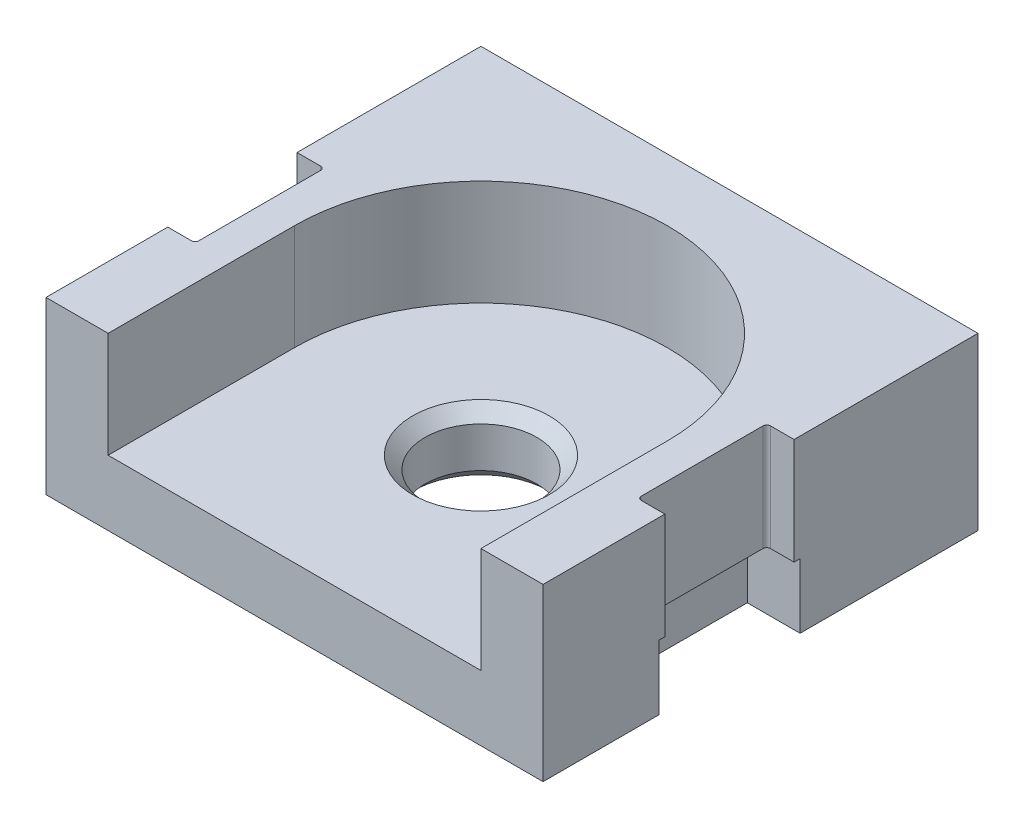
ISO-10303-21;
HEADER;
FILE_DESCRIPTION(('STEP AP214'),'2;1');
FILE_NAME('part.step','',(''),(''),'','','');
FILE_SCHEMA(('AUTOMOTIVE_DESIGN { 1 0 10303 214 1 1 1 1 }'));
ENDSEC;
DATA;
#1=APPLICATION_CONTEXT('core data for automotive mechanical design processes');
#2=APPLICATION_PROTOCOL_DEFINITION('international standard','automotive_design',2000,#1);
#3=PRODUCT_CONTEXT('',#1,'mechanical');
#4=PRODUCT('Part','Part','',(#3));
#5=PRODUCT_RELATED_PRODUCT_CATEGORY('part','',(#4));
#6=PRODUCT_DEFINITION_FORMATION('','',#4);
#7=PRODUCT_DEFINITION_CONTEXT('part definition',#1,'design');
#8=PRODUCT_DEFINITION('design','',#6,#7);
#9=PRODUCT_DEFINITION_SHAPE('','',#8);
#10=(LENGTH_UNIT() NAMED_UNIT(*) SI_UNIT(.MILLI.,.METRE.));
#11=(NAMED_UNIT(*) PLANE_ANGLE_UNIT() SI_UNIT($,.RADIAN.));
#12=(NAMED_UNIT(*) SI_UNIT($,.STERADIAN.) SOLID_ANGLE_UNIT());
#13=UNCERTAINTY_MEASURE_WITH_UNIT(LENGTH_MEASURE(1.E-05),#10,'distance_accuracy_value','');
#14=(GEOMETRIC_REPRESENTATION_CONTEXT(3) GLOBAL_UNCERTAINTY_ASSIGNED_CONTEXT((#13)) GLOBAL_UNIT_ASSIGNED_CONTEXT((#10,
#11,#12)) REPRESENTATION_CONTEXT('',''));
#15=CARTESIAN_POINT('',(0.,0.,0.));
#16=DIRECTION('',(0.,0.,1.));
#17=DIRECTION('',(1.,0.,0.));
#18=AXIS2_PLACEMENT_3D('',#15,#16,#17);
#19=CARTESIAN_POINT('',(-20.,8.,20.));
#20=DIRECTION('',(1.,0.,0.));
#21=DIRECTION('',(0.,0.,-1.));
#22=AXIS2_PLACEMENT_3D('',#19,#20,#21);
#23=PLANE('',#22);
#24=DIRECTION('',(0.,-1.,0.));
#25=VECTOR('',#24,1.);
#26=CARTESIAN_POINT('',(-20.,7.83430283036086,5.68284271247462));
#27=LINE('',#26,#25);
#28=CARTESIAN_POINT('',(-20.,-4.3,5.68284271247462));
#29=VERTEX_POINT('',#28);
#30=CARTESIAN_POINT('',(-20.,-9.5,5.68284271247462));
#31=VERTEX_POINT('',#30);
#32=EDGE_CURVE('E380',#29,#31,#27,.T.);
#33=ORIENTED_EDGE('',*,*,#32,.T.);
#34=DIRECTION('',(0.,0.,1.));
#35=VECTOR('',#34,1.);
#36=CARTESIAN_POINT('',(-20.,-9.5,20.));
#37=LINE('',#36,#35);
#38=CARTESIAN_POINT('',(-20.,-9.5,15.));
#39=VERTEX_POINT('',#38);
#40=EDGE_CURVE('E182',#31,#39,#37,.T.);
#41=ORIENTED_EDGE('',*,*,#40,.T.);
#42=DIRECTION('',(0.,1.,0.));
#43=VECTOR('',#42,1.);
#44=CARTESIAN_POINT('',(-20.,-8.,15.));
#45=LINE('',#44,#43);
#46=CARTESIAN_POINT('',(-20.,4.25,15.));
#47=VERTEX_POINT('',#46);
#48=EDGE_CURVE('E131',#39,#47,#45,.T.);
#49=ORIENTED_EDGE('',*,*,#48,.T.);
#50=DIRECTION('',(0.,0.,-1.));
#51=VECTOR('',#50,1.);
#52=CARTESIAN_POINT('',(-20.,4.25,20.));
#53=LINE('',#52,#51);
#54=CARTESIAN_POINT('',(-20.,4.25,5.2));
#55=VERTEX_POINT('',#54);
#56=EDGE_CURVE('E172',#47,#55,#53,.T.);
#57=ORIENTED_EDGE('',*,*,#56,.T.);
#58=DIRECTION('',(0.,1.,0.));
#59=VECTOR('',#58,1.);
#60=CARTESIAN_POINT('',(-20.,0.,5.2));
#61=LINE('',#60,#59);
#62=CARTESIAN_POINT('',(-20.,-4.3,5.2));
#63=VERTEX_POINT('',#62);
#64=EDGE_CURVE('E460',#63,#55,#61,.T.);
#65=ORIENTED_EDGE('',*,*,#64,.F.);
#66=DIRECTION('',(0.,0.,-1.));
#67=VECTOR('',#66,1.);
#68=CARTESIAN_POINT('',(-20.,-4.3,5.68284271247462));
#69=LINE('',#68,#67);
#70=EDGE_CURVE('E383',#29,#63,#69,.T.);
#71=ORIENTED_EDGE('',*,*,#70,.F.);
#72=EDGE_LOOP('',(#33,#41,#49,#57,#65,#71));
#73=FACE_BOUND('',#72,.T.);
#74=ADVANCED_FACE('F37',(#73),#23,.F.);
#75=CARTESIAN_POINT('',(0.,-9.5,0.));
#76=DIRECTION('',(0.,-1.,0.));
#77=DIRECTION('',(0.,0.,1.));
#78=AXIS2_PLACEMENT_3D('',#75,#76,#77);
#79=PLANE('',#78);
#80=CARTESIAN_POINT('',(0.,-9.5,0.));
#81=DIRECTION('',(0.,-1.,0.));
#82=DIRECTION('',(0.,0.,-1.));
#83=AXIS2_PLACEMENT_3D('',#80,#81,#82);
#84=CIRCLE('',#83,5.50000000000002);
#85=CARTESIAN_POINT('',(0.,-9.5,-5.50000000000002));
#86=VERTEX_POINT('',#85);
#87=EDGE_CURVE('E11',#86,#86,#84,.F.);
#88=ORIENTED_EDGE('',*,*,#87,.T.);
#89=EDGE_LOOP('',(#88));
#90=FACE_BOUND('',#89,.T.);
#91=DIRECTION('',(0.,0.,-1.));
#92=VECTOR('',#91,1.);
#93=CARTESIAN_POINT('',(-15.75,-9.5,5.68284271247462));
#94=LINE('',#93,#92);
#95=CARTESIAN_POINT('',(-15.75,-9.5,5.68284271247462));
#96=VERTEX_POINT('',#95);
#97=CARTESIAN_POINT('',(-15.75,-9.5,-5.68284271247462));
#98=VERTEX_POINT('',#97);
#99=EDGE_CURVE('E356',#96,#98,#94,.T.);
#100=ORIENTED_EDGE('',*,*,#99,.T.);
#101=DIRECTION('',(-1.,0.,0.));
#102=VECTOR('',#101,1.);
#103=CARTESIAN_POINT('',(-20.,-9.5,-5.68284271247462));
#104=LINE('',#103,#102);
#105=CARTESIAN_POINT('',(-20.,-9.5,-5.68284271247462));
#106=VERTEX_POINT('',#105);
#107=EDGE_CURVE('E343',#98,#106,#104,.T.);
#108=ORIENTED_EDGE('',*,*,#107,.T.);
#109=CARTESIAN_POINT('',(-20.,-9.5,-20.));
#110=VERTEX_POINT('',#109);
#111=EDGE_CURVE('E156',#110,#106,#37,.T.);
#112=ORIENTED_EDGE('',*,*,#111,.F.);
#113=DIRECTION('',(-1.,0.,0.));
#114=VECTOR('',#113,1.);
#115=CARTESIAN_POINT('',(20.,-9.5,-20.));
#116=LINE('',#115,#114);
#117=CARTESIAN_POINT('',(20.,-9.5,-20.));
#118=VERTEX_POINT('',#117);
#119=EDGE_CURVE('E179',#118,#110,#116,.T.);
#120=ORIENTED_EDGE('',*,*,#119,.F.);
#121=DIRECTION('',(0.,0.,-1.));
#122=VECTOR('',#121,1.);
#123=CARTESIAN_POINT('',(20.,-9.5,20.));
#124=LINE('',#123,#122);
#125=CARTESIAN_POINT('',(20.,-9.5,-5.68284271247462));
#126=VERTEX_POINT('',#125);
#127=EDGE_CURVE('E153',#126,#118,#124,.T.);
#128=ORIENTED_EDGE('',*,*,#127,.F.);
#129=DIRECTION('',(1.,0.,0.));
#130=VECTOR('',#129,1.);
#131=CARTESIAN_POINT('',(20.,-9.5,-5.68284271247462));
#132=LINE('',#131,#130);
#133=CARTESIAN_POINT('',(15.75,-9.5,-5.68284271247462));
#134=VERTEX_POINT('',#133);
#135=EDGE_CURVE('E398',#134,#126,#132,.T.);
#136=ORIENTED_EDGE('',*,*,#135,.F.);
#137=DIRECTION('',(0.,0.,-1.));
#138=VECTOR('',#137,1.);
#139=CARTESIAN_POINT('',(15.75,-9.5,5.68284271247462));
#140=LINE('',#139,#138);
#141=CARTESIAN_POINT('',(15.75,-9.5,5.68284271247462));
#142=VERTEX_POINT('',#141);
#143=EDGE_CURVE('E402',#142,#134,#140,.T.);
#144=ORIENTED_EDGE('',*,*,#143,.F.);
#145=DIRECTION('',(-1.,0.,0.));
#146=VECTOR('',#145,1.);
#147=CARTESIAN_POINT('',(20.,-9.5,5.68284271247462));
#148=LINE('',#147,#146);
#149=CARTESIAN_POINT('',(20.,-9.5,5.68284271247462));
#150=VERTEX_POINT('',#149);
#151=EDGE_CURVE('E391',#150,#142,#148,.T.);
#152=ORIENTED_EDGE('',*,*,#151,.F.);
#153=CARTESIAN_POINT('',(20.,-9.5,15.));
#154=VERTEX_POINT('',#153);
#155=EDGE_CURVE('E177',#154,#150,#124,.T.);
#156=ORIENTED_EDGE('',*,*,#155,.F.);
#157=DIRECTION('',(-1.,0.,0.));
#158=VECTOR('',#157,1.);
#159=CARTESIAN_POINT('',(-20.,-9.5,15.));
#160=LINE('',#159,#158);
#161=EDGE_CURVE('E130',#154,#39,#160,.T.);
#162=ORIENTED_EDGE('',*,*,#161,.T.);
#163=ORIENTED_EDGE('',*,*,#40,.F.);
#164=DIRECTION('',(1.,0.,0.));
#165=VECTOR('',#164,1.);
#166=CARTESIAN_POINT('',(-20.,-9.5,5.68284271247462));
#167=LINE('',#166,#165);
#168=EDGE_CURVE('E349',#31,#96,#167,.T.);
#169=ORIENTED_EDGE('',*,*,#168,.T.);
#170=EDGE_LOOP('',(#100,#108,#112,#120,#128,#136,#144,#152,#156,#162,#163,#169));
#171=FACE_BOUND('',#170,.T.);
#172=ADVANCED_FACE('F352',(#90,#171),#79,.T.);
#173=DIRECTION('',(0.,-1.,0.));
#174=VECTOR('',#173,1.);
#175=CARTESIAN_POINT('',(-20.,7.83430283036086,-5.68284271247462));
#176=LINE('',#175,#174);
#177=CARTESIAN_POINT('',(-20.,-4.3,-5.68284271247462));
#178=VERTEX_POINT('',#177);
#179=EDGE_CURVE('E339',#178,#106,#176,.T.);
#180=ORIENTED_EDGE('',*,*,#179,.F.);
#181=CARTESIAN_POINT('',(-20.,-4.3,-5.2));
#182=VERTEX_POINT('',#181);
#183=EDGE_CURVE('E548',#182,#178,#69,.T.);
#184=ORIENTED_EDGE('',*,*,#183,.F.);
#185=DIRECTION('',(0.,1.,0.));
#186=VECTOR('',#185,1.);
#187=CARTESIAN_POINT('',(-20.,0.,-5.2));
#188=LINE('',#187,#186);
#189=CARTESIAN_POINT('',(-20.,4.25,-5.2));
#190=VERTEX_POINT('',#189);
#191=EDGE_CURVE('E472',#182,#190,#188,.T.);
#192=ORIENTED_EDGE('',*,*,#191,.T.);
#193=CARTESIAN_POINT('',(-20.,4.25,-20.));
#194=VERTEX_POINT('',#193);
#195=EDGE_CURVE('E124',#190,#194,#53,.T.);
#196=ORIENTED_EDGE('',*,*,#195,.T.);
#197=DIRECTION('',(0.,-1.,0.));
#198=VECTOR('',#197,1.);
#199=CARTESIAN_POINT('',(-20.,8.,-20.));
#200=LINE('',#199,#198);
#201=EDGE_CURVE('E75',#194,#110,#200,.T.);
#202=ORIENTED_EDGE('',*,*,#201,.T.);
#203=ORIENTED_EDGE('',*,*,#111,.T.);
#204=EDGE_LOOP('',(#180,#184,#192,#196,#202,#203));
#205=FACE_BOUND('',#204,.T.);
#206=ADVANCED_FACE('F358',(#205),#23,.F.);
#207=CARTESIAN_POINT('',(-18.1,4.25,4.9));
#208=DIRECTION('',(0.,-1.,0.));
#209=DIRECTION('',(1.,0.,0.));
#210=AXIS2_PLACEMENT_3D('',#207,#208,#209);
#211=CYLINDRICAL_SURFACE('',#210,0.3);
#212=CARTESIAN_POINT('',(-18.1,-4.3,4.9));
#213=DIRECTION('',(0.,-1.,0.));
#214=DIRECTION('',(0.,0.,-1.));
#215=AXIS2_PLACEMENT_3D('',#212,#213,#214);
#216=CIRCLE('',#215,0.3);
#217=CARTESIAN_POINT('',(-18.1,-4.3,5.2));
#218=VERTEX_POINT('',#217);
#219=CARTESIAN_POINT('',(-17.8,-4.3,4.9));
#220=VERTEX_POINT('',#219);
#221=EDGE_CURVE('E510',#218,#220,#216,.F.);
#222=ORIENTED_EDGE('',*,*,#221,.F.);
#223=DIRECTION('',(0.,1.,0.));
#224=VECTOR('',#223,1.);
#225=CARTESIAN_POINT('',(-18.1,0.,5.2));
#226=LINE('',#225,#224);
#227=CARTESIAN_POINT('',(-18.1,4.25,5.2));
#228=VERTEX_POINT('',#227);
#229=EDGE_CURVE('E466',#218,#228,#226,.T.);
#230=ORIENTED_EDGE('',*,*,#229,.T.);
#231=CARTESIAN_POINT('',(-18.1,4.25,4.9));
#232=DIRECTION('',(0.,-1.,0.));
#233=DIRECTION('',(1.,0.,0.));
#234=AXIS2_PLACEMENT_3D('',#231,#232,#233);
#235=CIRCLE('',#234,0.3);
#236=CARTESIAN_POINT('',(-17.8,4.25,4.9));
#237=VERTEX_POINT('',#236);
#238=EDGE_CURVE('E465',#228,#237,#235,.F.);
#239=ORIENTED_EDGE('',*,*,#238,.T.);
#240=DIRECTION('',(0.,-1.,0.));
#241=VECTOR('',#240,1.);
#242=CARTESIAN_POINT('',(-17.8,4.25,4.9));
#243=LINE('',#242,#241);
#244=EDGE_CURVE('E462',#237,#220,#243,.T.);
#245=ORIENTED_EDGE('',*,*,#244,.T.);
#246=EDGE_LOOP('',(#222,#230,#239,#245));
#247=FACE_BOUND('',#246,.T.);
#248=ADVANCED_FACE('F360',(#247),#211,.F.);
#249=CARTESIAN_POINT('',(0.,0.,5.2));
#250=DIRECTION('',(0.,0.,-1.));
#251=DIRECTION('',(-1.,0.,0.));
#252=AXIS2_PLACEMENT_3D('',#249,#250,#251);
#253=PLANE('',#252);
#254=ORIENTED_EDGE('',*,*,#229,.F.);
#255=DIRECTION('',(-1.,0.,0.));
#256=VECTOR('',#255,1.);
#257=CARTESIAN_POINT('',(0.,-4.3,5.2));
#258=LINE('',#257,#256);
#259=EDGE_CURVE('E512',#218,#63,#258,.T.);
#260=ORIENTED_EDGE('',*,*,#259,.T.);
#261=ORIENTED_EDGE('',*,*,#64,.T.);
#262=DIRECTION('',(-1.,0.,0.));
#263=VECTOR('',#262,1.);
#264=CARTESIAN_POINT('',(0.,4.25,5.2));
#265=LINE('',#264,#263);
#266=EDGE_CURVE('E468',#55,#228,#265,.F.);
#267=ORIENTED_EDGE('',*,*,#266,.T.);
#268=EDGE_LOOP('',(#254,#260,#261,#267));
#269=FACE_BOUND('',#268,.T.);
#270=ADVANCED_FACE('F366',(#269),#253,.T.);
#271=CARTESIAN_POINT('',(-18.1,0.,-4.9));
#272=DIRECTION('',(0.,1.,0.));
#273=DIRECTION('',(-1.,0.,0.));
#274=AXIS2_PLACEMENT_3D('',#271,#272,#273);
#275=CYLINDRICAL_SURFACE('',#274,0.3);
#276=CARTESIAN_POINT('',(-18.1,-4.3,-4.9));
#277=DIRECTION('',(0.,-1.,0.));
#278=DIRECTION('',(0.,0.,-1.));
#279=AXIS2_PLACEMENT_3D('',#276,#277,#278);
#280=CIRCLE('',#279,0.3);
#281=CARTESIAN_POINT('',(-17.8,-4.3,-4.9));
#282=VERTEX_POINT('',#281);
#283=CARTESIAN_POINT('',(-18.1,-4.3,-5.2));
#284=VERTEX_POINT('',#283);
#285=EDGE_CURVE('E506',#282,#284,#280,.F.);
#286=ORIENTED_EDGE('',*,*,#285,.F.);
#287=DIRECTION('',(0.,-1.,0.));
#288=VECTOR('',#287,1.);
#289=CARTESIAN_POINT('',(-17.8,4.25,-4.9));
#290=LINE('',#289,#288);
#291=CARTESIAN_POINT('',(-17.8,4.25,-4.9));
#292=VERTEX_POINT('',#291);
#293=EDGE_CURVE('E458',#282,#292,#290,.F.);
#294=ORIENTED_EDGE('',*,*,#293,.T.);
#295=CARTESIAN_POINT('',(-18.1,4.25,-4.9));
#296=DIRECTION('',(0.,1.,0.));
#297=DIRECTION('',(-1.,0.,0.));
#298=AXIS2_PLACEMENT_3D('',#295,#296,#297);
#299=CIRCLE('',#298,0.3);
#300=CARTESIAN_POINT('',(-18.1,4.25,-5.2));
#301=VERTEX_POINT('',#300);
#302=EDGE_CURVE('E461',#292,#301,#299,.T.);
#303=ORIENTED_EDGE('',*,*,#302,.T.);
#304=DIRECTION('',(0.,1.,0.));
#305=VECTOR('',#304,1.);
#306=CARTESIAN_POINT('',(-18.1,0.,-5.2));
#307=LINE('',#306,#305);
#308=EDGE_CURVE('E469',#301,#284,#307,.F.);
#309=ORIENTED_EDGE('',*,*,#308,.T.);
#310=EDGE_LOOP('',(#286,#294,#303,#309));
#311=FACE_BOUND('',#310,.T.);
#312=ADVANCED_FACE('F505',(#311),#275,.F.);
#313=CARTESIAN_POINT('',(0.,0.,-5.2));
#314=DIRECTION('',(0.,0.,-1.));
#315=DIRECTION('',(-1.,0.,0.));
#316=AXIS2_PLACEMENT_3D('',#313,#314,#315);
#317=PLANE('',#316);
#318=DIRECTION('',(-1.,0.,0.));
#319=VECTOR('',#318,1.);
#320=CARTESIAN_POINT('',(0.,-4.3,-5.2));
#321=LINE('',#320,#319);
#322=EDGE_CURVE('E513',#284,#182,#321,.T.);
#323=ORIENTED_EDGE('',*,*,#322,.F.);
#324=ORIENTED_EDGE('',*,*,#308,.F.);
#325=DIRECTION('',(-1.,0.,0.));
#326=VECTOR('',#325,1.);
#327=CARTESIAN_POINT('',(0.,4.25,-5.2));
#328=LINE('',#327,#326);
#329=EDGE_CURVE('E457',#190,#301,#328,.F.);
#330=ORIENTED_EDGE('',*,*,#329,.F.);
#331=ORIENTED_EDGE('',*,*,#191,.F.);
#332=EDGE_LOOP('',(#323,#324,#330,#331));
#333=FACE_BOUND('',#332,.T.);
#334=ADVANCED_FACE('F550',(#333),#317,.F.);
#335=CARTESIAN_POINT('',(18.1,4.25,4.9));
#336=DIRECTION('',(0.,-1.,0.));
#337=DIRECTION('',(-1.,0.,0.));
#338=AXIS2_PLACEMENT_3D('',#335,#336,#337);
#339=CYLINDRICAL_SURFACE('',#338,0.3);
#340=CARTESIAN_POINT('',(18.1,-4.3,4.9));
#341=DIRECTION('',(0.,-1.,0.));
#342=DIRECTION('',(0.,0.,-1.));
#343=AXIS2_PLACEMENT_3D('',#340,#341,#342);
#344=CIRCLE('',#343,0.3);
#345=CARTESIAN_POINT('',(17.8,-4.3,4.9));
#346=VERTEX_POINT('',#345);
#347=CARTESIAN_POINT('',(18.1,-4.3,5.2));
#348=VERTEX_POINT('',#347);
#349=EDGE_CURVE('E410',#346,#348,#344,.F.);
#350=ORIENTED_EDGE('',*,*,#349,.F.);
#351=DIRECTION('',(0.,-1.,0.));
#352=VECTOR('',#351,1.);
#353=CARTESIAN_POINT('',(17.8,4.25,4.9));
#354=LINE('',#353,#352);
#355=CARTESIAN_POINT('',(17.8,4.25,4.9));
#356=VERTEX_POINT('',#355);
#357=EDGE_CURVE('E425',#356,#346,#354,.T.);
#358=ORIENTED_EDGE('',*,*,#357,.F.);
#359=CARTESIAN_POINT('',(18.1,4.25,4.9));
#360=DIRECTION('',(0.,1.,0.));
#361=DIRECTION('',(-1.,0.,0.));
#362=AXIS2_PLACEMENT_3D('',#359,#360,#361);
#363=CIRCLE('',#362,0.3);
#364=CARTESIAN_POINT('',(18.1,4.25,5.2));
#365=VERTEX_POINT('',#364);
#366=EDGE_CURVE('E429',#365,#356,#363,.F.);
#367=ORIENTED_EDGE('',*,*,#366,.F.);
#368=DIRECTION('',(0.,1.,0.));
#369=VECTOR('',#368,1.);
#370=CARTESIAN_POINT('',(18.1,0.,5.2));
#371=LINE('',#370,#369);
#372=EDGE_CURVE('E430',#348,#365,#371,.T.);
#373=ORIENTED_EDGE('',*,*,#372,.F.);
#374=EDGE_LOOP('',(#350,#358,#367,#373));
#375=FACE_BOUND('',#374,.T.);
#376=ADVANCED_FACE('F585',(#375),#339,.F.);
#377=CARTESIAN_POINT('',(0.,0.,5.2));
#378=DIRECTION('',(0.,0.,-1.));
#379=DIRECTION('',(1.,0.,0.));
#380=AXIS2_PLACEMENT_3D('',#377,#378,#379);
#381=PLANE('',#380);
#382=DIRECTION('',(0.,1.,0.));
#383=VECTOR('',#382,1.);
#384=CARTESIAN_POINT('',(20.,0.,5.2));
#385=LINE('',#384,#383);
#386=CARTESIAN_POINT('',(20.,-4.3,5.2));
#387=VERTEX_POINT('',#386);
#388=CARTESIAN_POINT('',(20.,4.25,5.2));
#389=VERTEX_POINT('',#388);
#390=EDGE_CURVE('E111',#387,#389,#385,.T.);
#391=ORIENTED_EDGE('',*,*,#390,.F.);
#392=DIRECTION('',(-1.,0.,0.));
#393=VECTOR('',#392,1.);
#394=CARTESIAN_POINT('',(0.,-4.3,5.2));
#395=LINE('',#394,#393);
#396=EDGE_CURVE('E414',#387,#348,#395,.T.);
#397=ORIENTED_EDGE('',*,*,#396,.T.);
#398=ORIENTED_EDGE('',*,*,#372,.T.);
#399=DIRECTION('',(1.,0.,0.));
#400=VECTOR('',#399,1.);
#401=CARTESIAN_POINT('',(0.,4.25,5.2));
#402=LINE('',#401,#400);
#403=EDGE_CURVE('E432',#389,#365,#402,.F.);
#404=ORIENTED_EDGE('',*,*,#403,.F.);
#405=EDGE_LOOP('',(#391,#397,#398,#404));
#406=FACE_BOUND('',#405,.T.);
#407=ADVANCED_FACE('F588',(#406),#381,.T.);
#408=CARTESIAN_POINT('',(18.1,0.,-4.9));
#409=DIRECTION('',(0.,1.,0.));
#410=DIRECTION('',(1.,0.,0.));
#411=AXIS2_PLACEMENT_3D('',#408,#409,#410);
#412=CYLINDRICAL_SURFACE('',#411,0.3);
#413=CARTESIAN_POINT('',(18.1,-4.3,-4.9));
#414=DIRECTION('',(0.,-1.,0.));
#415=DIRECTION('',(0.,0.,-1.));
#416=AXIS2_PLACEMENT_3D('',#413,#414,#415);
#417=CIRCLE('',#416,0.3);
#418=CARTESIAN_POINT('',(18.1,-4.3,-5.2));
#419=VERTEX_POINT('',#418);
#420=CARTESIAN_POINT('',(17.8,-4.3,-4.9));
#421=VERTEX_POINT('',#420);
#422=EDGE_CURVE('E408',#419,#421,#417,.F.);
#423=ORIENTED_EDGE('',*,*,#422,.F.);
#424=DIRECTION('',(0.,1.,0.));
#425=VECTOR('',#424,1.);
#426=CARTESIAN_POINT('',(18.1,0.,-5.2));
#427=LINE('',#426,#425);
#428=CARTESIAN_POINT('',(18.1,4.25,-5.2));
#429=VERTEX_POINT('',#428);
#430=EDGE_CURVE('E433',#429,#419,#427,.F.);
#431=ORIENTED_EDGE('',*,*,#430,.F.);
#432=CARTESIAN_POINT('',(18.1,4.25,-4.9));
#433=DIRECTION('',(0.,-1.,0.));
#434=DIRECTION('',(1.,0.,0.));
#435=AXIS2_PLACEMENT_3D('',#432,#433,#434);
#436=CIRCLE('',#435,0.3);
#437=CARTESIAN_POINT('',(17.8,4.25,-4.9));
#438=VERTEX_POINT('',#437);
#439=EDGE_CURVE('E424',#438,#429,#436,.T.);
#440=ORIENTED_EDGE('',*,*,#439,.F.);
#441=DIRECTION('',(0.,-1.,0.));
#442=VECTOR('',#441,1.);
#443=CARTESIAN_POINT('',(17.8,4.25,-4.9));
#444=LINE('',#443,#442);
#445=EDGE_CURVE('E421',#421,#438,#444,.F.);
#446=ORIENTED_EDGE('',*,*,#445,.F.);
#447=EDGE_LOOP('',(#423,#431,#440,#446));
#448=FACE_BOUND('',#447,.T.);
#449=ADVANCED_FACE('F592',(#448),#412,.F.);
#450=CARTESIAN_POINT('',(0.,0.,-5.2));
#451=DIRECTION('',(0.,0.,-1.));
#452=DIRECTION('',(1.,0.,0.));
#453=AXIS2_PLACEMENT_3D('',#450,#451,#452);
#454=PLANE('',#453);
#455=DIRECTION('',(-1.,0.,0.));
#456=VECTOR('',#455,1.);
#457=CARTESIAN_POINT('',(0.,-4.3,-5.2));
#458=LINE('',#457,#456);
#459=CARTESIAN_POINT('',(20.,-4.3,-5.2));
#460=VERTEX_POINT('',#459);
#461=EDGE_CURVE('E412',#460,#419,#458,.T.);
#462=ORIENTED_EDGE('',*,*,#461,.F.);
#463=DIRECTION('',(0.,1.,0.));
#464=VECTOR('',#463,1.);
#465=CARTESIAN_POINT('',(20.,0.,-5.2));
#466=LINE('',#465,#464);
#467=CARTESIAN_POINT('',(20.,4.25,-5.2));
#468=VERTEX_POINT('',#467);
#469=EDGE_CURVE('E436',#460,#468,#466,.T.);
#470=ORIENTED_EDGE('',*,*,#469,.T.);
#471=DIRECTION('',(1.,0.,0.));
#472=VECTOR('',#471,1.);
#473=CARTESIAN_POINT('',(0.,4.25,-5.2));
#474=LINE('',#473,#472);
#475=EDGE_CURVE('E420',#468,#429,#474,.F.);
#476=ORIENTED_EDGE('',*,*,#475,.T.);
#477=ORIENTED_EDGE('',*,*,#430,.T.);
#478=EDGE_LOOP('',(#462,#470,#476,#477));
#479=FACE_BOUND('',#478,.T.);
#480=ADVANCED_FACE('F596',(#479),#454,.F.);
#481=CARTESIAN_POINT('',(0.,4.25,0.));
#482=DIRECTION('',(0.,-1.,0.));
#483=DIRECTION('',(0.,0.,-1.));
#484=AXIS2_PLACEMENT_3D('',#481,#482,#483);
#485=PLANE('',#484);
#486=ORIENTED_EDGE('',*,*,#403,.T.);
#487=ORIENTED_EDGE('',*,*,#366,.T.);
#488=DIRECTION('',(0.,0.,1.));
#489=VECTOR('',#488,1.);
#490=CARTESIAN_POINT('',(17.8,4.25,-5.));
#491=LINE('',#490,#489);
#492=EDGE_CURVE('E428',#438,#356,#491,.T.);
#493=ORIENTED_EDGE('',*,*,#492,.F.);
#494=ORIENTED_EDGE('',*,*,#439,.T.);
#495=ORIENTED_EDGE('',*,*,#475,.F.);
#496=DIRECTION('',(0.,0.,1.));
#497=VECTOR('',#496,1.);
#498=CARTESIAN_POINT('',(20.,4.25,20.));
#499=LINE('',#498,#497);
#500=CARTESIAN_POINT('',(20.,4.25,-20.));
#501=VERTEX_POINT('',#500);
#502=EDGE_CURVE('E54',#501,#468,#499,.T.);
#503=ORIENTED_EDGE('',*,*,#502,.F.);
#504=DIRECTION('',(1.,0.,0.));
#505=VECTOR('',#504,1.);
#506=CARTESIAN_POINT('',(20.,4.25,-20.));
#507=LINE('',#506,#505);
#508=EDGE_CURVE('E114',#194,#501,#507,.T.);
#509=ORIENTED_EDGE('',*,*,#508,.F.);
#510=ORIENTED_EDGE('',*,*,#195,.F.);
#511=ORIENTED_EDGE('',*,*,#329,.T.);
#512=ORIENTED_EDGE('',*,*,#302,.F.);
#513=DIRECTION('',(0.,0.,1.));
#514=VECTOR('',#513,1.);
#515=CARTESIAN_POINT('',(-17.8,4.25,-5.));
#516=LINE('',#515,#514);
#517=EDGE_CURVE('E136',#292,#237,#516,.T.);
#518=ORIENTED_EDGE('',*,*,#517,.T.);
#519=ORIENTED_EDGE('',*,*,#238,.F.);
#520=ORIENTED_EDGE('',*,*,#266,.F.);
#521=ORIENTED_EDGE('',*,*,#56,.F.);
#522=DIRECTION('',(-1.,0.,0.));
#523=VECTOR('',#522,1.);
#524=CARTESIAN_POINT('',(-20.,4.25,15.));
#525=LINE('',#524,#523);
#526=CARTESIAN_POINT('',(-15.,4.25,15.));
#527=VERTEX_POINT('',#526);
#528=EDGE_CURVE('E125',#527,#47,#525,.T.);
#529=ORIENTED_EDGE('',*,*,#528,.F.);
#530=DIRECTION('',(0.,0.,1.));
#531=VECTOR('',#530,1.);
#532=CARTESIAN_POINT('',(-15.,4.25,0.));
#533=LINE('',#532,#531);
#534=CARTESIAN_POINT('',(-15.,4.25,0.));
#535=VERTEX_POINT('',#534);
#536=EDGE_CURVE('E155',#535,#527,#533,.T.);
#537=ORIENTED_EDGE('',*,*,#536,.F.);
#538=CARTESIAN_POINT('',(0.,4.25,0.));
#539=DIRECTION('',(0.,1.,0.));
#540=DIRECTION('',(0.,0.,1.));
#541=AXIS2_PLACEMENT_3D('',#538,#539,#540);
#542=CIRCLE('',#541,15.);
#543=CARTESIAN_POINT('',(15.,4.25,0.));
#544=VERTEX_POINT('',#543);
#545=EDGE_CURVE('E84',#544,#535,#542,.T.);
#546=ORIENTED_EDGE('',*,*,#545,.F.);
#547=DIRECTION('',(0.,0.,-1.));
#548=VECTOR('',#547,1.);
#549=CARTESIAN_POINT('',(15.,4.25,0.));
#550=LINE('',#549,#548);
#551=CARTESIAN_POINT('',(15.,4.25,15.));
#552=VERTEX_POINT('',#551);
#553=EDGE_CURVE('E121',#552,#544,#550,.T.);
#554=ORIENTED_EDGE('',*,*,#553,.F.);
#555=CARTESIAN_POINT('',(20.,4.25,15.));
#556=VERTEX_POINT('',#555);
#557=EDGE_CURVE('E118',#556,#552,#525,.T.);
#558=ORIENTED_EDGE('',*,*,#557,.F.);
#559=EDGE_CURVE('E101',#389,#556,#499,.T.);
#560=ORIENTED_EDGE('',*,*,#559,.F.);
#561=EDGE_LOOP('',(#486,#487,#493,#494,#495,#503,#509,#510,#511,#512,#518,#519,#520,#521,#529,
#537,#546,#554,#558,#560));
#562=FACE_BOUND('',#561,.T.);
#563=ADVANCED_FACE('F119',(#562),#485,.F.);
#564=CARTESIAN_POINT('',(20.,8.,20.));
#565=DIRECTION('',(-1.,0.,0.));
#566=DIRECTION('',(0.,0.,1.));
#567=AXIS2_PLACEMENT_3D('',#564,#565,#566);
#568=PLANE('',#567);
#569=ORIENTED_EDGE('',*,*,#155,.T.);
#570=DIRECTION('',(0.,-1.,0.));
#571=VECTOR('',#570,1.);
#572=CARTESIAN_POINT('',(20.,7.83430283036086,5.68284271247462));
#573=LINE('',#572,#571);
#574=CARTESIAN_POINT('',(20.,-4.3,5.68284271247462));
#575=VERTEX_POINT('',#574);
#576=EDGE_CURVE('E393',#575,#150,#573,.T.);
#577=ORIENTED_EDGE('',*,*,#576,.F.);
#578=DIRECTION('',(0.,0.,-1.));
#579=VECTOR('',#578,1.);
#580=CARTESIAN_POINT('',(20.,-4.3,5.68284271247462));
#581=LINE('',#580,#579);
#582=EDGE_CURVE('E395',#575,#387,#581,.T.);
#583=ORIENTED_EDGE('',*,*,#582,.T.);
#584=ORIENTED_EDGE('',*,*,#390,.T.);
#585=ORIENTED_EDGE('',*,*,#559,.T.);
#586=DIRECTION('',(0.,1.,0.));
#587=VECTOR('',#586,1.);
#588=CARTESIAN_POINT('',(20.,-8.,15.));
#589=LINE('',#588,#587);
#590=EDGE_CURVE('E106',#154,#556,#589,.T.);
#591=ORIENTED_EDGE('',*,*,#590,.F.);
#592=EDGE_LOOP('',(#569,#577,#583,#584,#585,#591));
#593=FACE_BOUND('',#592,.T.);
#594=ADVANCED_FACE('F104',(#593),#568,.F.);
#595=CARTESIAN_POINT('',(20.,8.,-20.));
#596=DIRECTION('',(0.,0.,1.));
#597=DIRECTION('',(1.,0.,0.));
#598=AXIS2_PLACEMENT_3D('',#595,#596,#597);
#599=PLANE('',#598);
#600=ORIENTED_EDGE('',*,*,#201,.F.);
#601=ORIENTED_EDGE('',*,*,#508,.T.);
#602=DIRECTION('',(0.,-1.,0.));
#603=VECTOR('',#602,1.);
#604=CARTESIAN_POINT('',(20.,8.,-20.));
#605=LINE('',#604,#603);
#606=EDGE_CURVE('E166',#501,#118,#605,.T.);
#607=ORIENTED_EDGE('',*,*,#606,.T.);
#608=ORIENTED_EDGE('',*,*,#119,.T.);
#609=EDGE_LOOP('',(#600,#601,#607,#608));
#610=FACE_BOUND('',#609,.T.);
#611=ADVANCED_FACE('F546',(#610),#599,.F.);
#612=CARTESIAN_POINT('',(20.,-4.3,-5.68284271247462));
#613=VERTEX_POINT('',#612);
#614=EDGE_CURVE('E525',#460,#613,#581,.T.);
#615=ORIENTED_EDGE('',*,*,#614,.T.);
#616=DIRECTION('',(0.,-1.,0.));
#617=VECTOR('',#616,1.);
#618=CARTESIAN_POINT('',(20.,7.83430283036086,-5.68284271247462));
#619=LINE('',#618,#617);
#620=EDGE_CURVE('E523',#613,#126,#619,.T.);
#621=ORIENTED_EDGE('',*,*,#620,.T.);
#622=ORIENTED_EDGE('',*,*,#127,.T.);
#623=ORIENTED_EDGE('',*,*,#606,.F.);
#624=ORIENTED_EDGE('',*,*,#502,.T.);
#625=ORIENTED_EDGE('',*,*,#469,.F.);
#626=EDGE_LOOP('',(#615,#621,#622,#623,#624,#625));
#627=FACE_BOUND('',#626,.T.);
#628=ADVANCED_FACE('F544',(#627),#568,.F.);
#629=CARTESIAN_POINT('',(0.,4.25,0.));
#630=DIRECTION('',(0.,-1.,0.));
#631=DIRECTION('',(0.,0.,-1.));
#632=AXIS2_PLACEMENT_3D('',#629,#630,#631);
#633=CYLINDRICAL_SURFACE('',#632,15.);
#634=DIRECTION('',(0.,-1.,0.));
#635=VECTOR('',#634,1.);
#636=CARTESIAN_POINT('',(-15.,4.25,0.));
#637=LINE('',#636,#635);
#638=CARTESIAN_POINT('',(-15.,-4.25,0.));
#639=VERTEX_POINT('',#638);
#640=EDGE_CURVE('E163',#535,#639,#637,.T.);
#641=ORIENTED_EDGE('',*,*,#640,.T.);
#642=CARTESIAN_POINT('',(0.,-4.25,0.));
#643=DIRECTION('',(0.,1.,0.));
#644=DIRECTION('',(0.,0.,1.));
#645=AXIS2_PLACEMENT_3D('',#642,#643,#644);
#646=CIRCLE('',#645,15.);
#647=CARTESIAN_POINT('',(15.,-4.25,0.));
#648=VERTEX_POINT('',#647);
#649=EDGE_CURVE('E144',#648,#639,#646,.T.);
#650=ORIENTED_EDGE('',*,*,#649,.F.);
#651=DIRECTION('',(0.,-1.,0.));
#652=VECTOR('',#651,1.);
#653=CARTESIAN_POINT('',(15.,4.25,0.));
#654=LINE('',#653,#652);
#655=EDGE_CURVE('E160',#544,#648,#654,.T.);
#656=ORIENTED_EDGE('',*,*,#655,.F.);
#657=ORIENTED_EDGE('',*,*,#545,.T.);
#658=EDGE_LOOP('',(#641,#650,#656,#657));
#659=FACE_BOUND('',#658,.T.);
#660=ADVANCED_FACE('F203',(#659),#633,.F.);
#661=CARTESIAN_POINT('',(0.,-4.25,0.));
#662=DIRECTION('',(0.,-1.,0.));
#663=DIRECTION('',(0.,0.,1.));
#664=AXIS2_PLACEMENT_3D('',#661,#662,#663);
#665=PLANE('',#664);
#666=CARTESIAN_POINT('',(0.,-4.25,0.));
#667=DIRECTION('',(0.,-1.,0.));
#668=DIRECTION('',(0.,0.,-1.));
#669=AXIS2_PLACEMENT_3D('',#666,#667,#668);
#670=CIRCLE('',#669,5.49999999999999);
#671=CARTESIAN_POINT('',(0.,-4.25,-5.5));
#672=VERTEX_POINT('',#671);
#673=EDGE_CURVE('E175',#672,#672,#670,.T.);
#674=ORIENTED_EDGE('',*,*,#673,.T.);
#675=EDGE_LOOP('',(#674));
#676=FACE_BOUND('',#675,.T.);
#677=DIRECTION('',(0.,0.,1.));
#678=VECTOR('',#677,1.);
#679=CARTESIAN_POINT('',(-15.,-4.25,0.));
#680=LINE('',#679,#678);
#681=CARTESIAN_POINT('',(-15.,-4.25,15.));
#682=VERTEX_POINT('',#681);
#683=EDGE_CURVE('E147',#639,#682,#680,.T.);
#684=ORIENTED_EDGE('',*,*,#683,.T.);
#685=DIRECTION('',(1.,0.,0.));
#686=VECTOR('',#685,1.);
#687=CARTESIAN_POINT('',(0.,-4.25,15.));
#688=LINE('',#687,#686);
#689=CARTESIAN_POINT('',(15.,-4.25,15.));
#690=VERTEX_POINT('',#689);
#691=EDGE_CURVE('E169',#682,#690,#688,.T.);
#692=ORIENTED_EDGE('',*,*,#691,.T.);
#693=DIRECTION('',(0.,0.,-1.));
#694=VECTOR('',#693,1.);
#695=CARTESIAN_POINT('',(15.,-4.25,0.));
#696=LINE('',#695,#694);
#697=EDGE_CURVE('E150',#690,#648,#696,.T.);
#698=ORIENTED_EDGE('',*,*,#697,.T.);
#699=ORIENTED_EDGE('',*,*,#649,.T.);
#700=EDGE_LOOP('',(#684,#692,#698,#699));
#701=FACE_BOUND('',#700,.T.);
#702=ADVANCED_FACE('F200',(#676,#701),#665,.F.);
#703=CARTESIAN_POINT('',(-20.,-8.,15.));
#704=DIRECTION('',(0.,0.,-1.));
#705=DIRECTION('',(-1.,0.,0.));
#706=AXIS2_PLACEMENT_3D('',#703,#704,#705);
#707=PLANE('',#706);
#708=ORIENTED_EDGE('',*,*,#590,.T.);
#709=ORIENTED_EDGE('',*,*,#557,.T.);
#710=DIRECTION('',(0.,-1.,0.));
#711=VECTOR('',#710,1.);
#712=CARTESIAN_POINT('',(15.,4.25,15.));
#713=LINE('',#712,#711);
#714=EDGE_CURVE('E134',#552,#690,#713,.T.);
#715=ORIENTED_EDGE('',*,*,#714,.T.);
#716=ORIENTED_EDGE('',*,*,#691,.F.);
#717=DIRECTION('',(0.,1.,0.));
#718=VECTOR('',#717,1.);
#719=CARTESIAN_POINT('',(-15.,4.25,15.));
#720=LINE('',#719,#718);
#721=EDGE_CURVE('E141',#682,#527,#720,.T.);
#722=ORIENTED_EDGE('',*,*,#721,.T.);
#723=ORIENTED_EDGE('',*,*,#528,.T.);
#724=ORIENTED_EDGE('',*,*,#48,.F.);
#725=ORIENTED_EDGE('',*,*,#161,.F.);
#726=EDGE_LOOP('',(#708,#709,#715,#716,#722,#723,#724,#725));
#727=FACE_BOUND('',#726,.T.);
#728=ADVANCED_FACE('F127',(#727),#707,.F.);
#729=CARTESIAN_POINT('',(-15.,4.25,0.));
#730=DIRECTION('',(1.,0.,0.));
#731=DIRECTION('',(0.,0.,-1.));
#732=AXIS2_PLACEMENT_3D('',#729,#730,#731);
#733=PLANE('',#732);
#734=ORIENTED_EDGE('',*,*,#721,.F.);
#735=ORIENTED_EDGE('',*,*,#683,.F.);
#736=ORIENTED_EDGE('',*,*,#640,.F.);
#737=ORIENTED_EDGE('',*,*,#536,.T.);
#738=EDGE_LOOP('',(#734,#735,#736,#737));
#739=FACE_BOUND('',#738,.T.);
#740=ADVANCED_FACE('F214',(#739),#733,.T.);
#741=CARTESIAN_POINT('',(15.,4.25,0.));
#742=DIRECTION('',(-1.,0.,0.));
#743=DIRECTION('',(0.,0.,1.));
#744=AXIS2_PLACEMENT_3D('',#741,#742,#743);
#745=PLANE('',#744);
#746=ORIENTED_EDGE('',*,*,#714,.F.);
#747=ORIENTED_EDGE('',*,*,#553,.T.);
#748=ORIENTED_EDGE('',*,*,#655,.T.);
#749=ORIENTED_EDGE('',*,*,#697,.F.);
#750=EDGE_LOOP('',(#746,#747,#748,#749));
#751=FACE_BOUND('',#750,.T.);
#752=ADVANCED_FACE('F617',(#751),#745,.T.);
#753=CARTESIAN_POINT('',(0.,8.,0.));
#754=DIRECTION('',(0.,-1.,0.));
#755=DIRECTION('',(0.,0.,-1.));
#756=AXIS2_PLACEMENT_3D('',#753,#754,#755);
#757=CYLINDRICAL_SURFACE('',#756,4.5);
#758=CARTESIAN_POINT('',(0.,-5.25,0.));
#759=DIRECTION('',(0.,-1.,0.));
#760=DIRECTION('',(0.,0.,-1.));
#761=AXIS2_PLACEMENT_3D('',#758,#759,#760);
#762=CIRCLE('',#761,4.5);
#763=CARTESIAN_POINT('',(0.,-5.25,-4.5));
#764=VERTEX_POINT('',#763);
#765=EDGE_CURVE('E46',#764,#764,#762,.F.);
#766=ORIENTED_EDGE('',*,*,#765,.T.);
#767=EDGE_LOOP('',(#766));
#768=FACE_BOUND('',#767,.T.);
#769=CARTESIAN_POINT('',(0.,-8.49999999999999,0.));
#770=DIRECTION('',(0.,-1.,0.));
#771=DIRECTION('',(0.,0.,-1.));
#772=AXIS2_PLACEMENT_3D('',#769,#770,#771);
#773=CIRCLE('',#772,4.5);
#774=CARTESIAN_POINT('',(0.,-8.49999999999999,-4.5));
#775=VERTEX_POINT('',#774);
#776=EDGE_CURVE('E186',#775,#775,#773,.T.);
#777=ORIENTED_EDGE('',*,*,#776,.T.);
#778=EDGE_LOOP('',(#777));
#779=FACE_BOUND('',#778,.T.);
#780=ADVANCED_FACE('F191',(#768,#779),#757,.F.);
#781=CARTESIAN_POINT('',(-17.8,4.25,-5.));
#782=DIRECTION('',(-1.,0.,0.));
#783=DIRECTION('',(0.,-1.,0.));
#784=AXIS2_PLACEMENT_3D('',#781,#782,#783);
#785=PLANE('',#784);
#786=DIRECTION('',(0.,0.,1.));
#787=VECTOR('',#786,1.);
#788=CARTESIAN_POINT('',(-17.8,-4.3,-5.));
#789=LINE('',#788,#787);
#790=EDGE_CURVE('E440',#282,#220,#789,.T.);
#791=ORIENTED_EDGE('',*,*,#790,.T.);
#792=ORIENTED_EDGE('',*,*,#244,.F.);
#793=ORIENTED_EDGE('',*,*,#517,.F.);
#794=ORIENTED_EDGE('',*,*,#293,.F.);
#795=EDGE_LOOP('',(#791,#792,#793,#794));
#796=FACE_BOUND('',#795,.T.);
#797=ADVANCED_FACE('F498',(#796),#785,.T.);
#798=CARTESIAN_POINT('',(-18.,-4.3,-5.));
#799=DIRECTION('',(0.,-1.,0.));
#800=DIRECTION('',(0.,0.,-1.));
#801=AXIS2_PLACEMENT_3D('',#798,#799,#800);
#802=PLANE('',#801);
#803=ORIENTED_EDGE('',*,*,#790,.F.);
#804=ORIENTED_EDGE('',*,*,#285,.T.);
#805=ORIENTED_EDGE('',*,*,#322,.T.);
#806=ORIENTED_EDGE('',*,*,#183,.T.);
#807=DIRECTION('',(1.,0.,0.));
#808=VECTOR('',#807,1.);
#809=CARTESIAN_POINT('',(-20.,-4.3,-5.68284271247462));
#810=LINE('',#809,#808);
#811=CARTESIAN_POINT('',(-15.75,-4.3,-5.68284271247462));
#812=VERTEX_POINT('',#811);
#813=EDGE_CURVE('E346',#178,#812,#810,.T.);
#814=ORIENTED_EDGE('',*,*,#813,.T.);
#815=DIRECTION('',(0.,0.,1.));
#816=VECTOR('',#815,1.);
#817=CARTESIAN_POINT('',(-15.75,-4.3,5.68284271247462));
#818=LINE('',#817,#816);
#819=CARTESIAN_POINT('',(-15.75,-4.3,5.68284271247462));
#820=VERTEX_POINT('',#819);
#821=EDGE_CURVE('E554',#812,#820,#818,.T.);
#822=ORIENTED_EDGE('',*,*,#821,.T.);
#823=DIRECTION('',(-1.,0.,0.));
#824=VECTOR('',#823,1.);
#825=CARTESIAN_POINT('',(-20.,-4.3,5.68284271247462));
#826=LINE('',#825,#824);
#827=EDGE_CURVE('E552',#820,#29,#826,.T.);
#828=ORIENTED_EDGE('',*,*,#827,.T.);
#829=ORIENTED_EDGE('',*,*,#70,.T.);
#830=ORIENTED_EDGE('',*,*,#259,.F.);
#831=ORIENTED_EDGE('',*,*,#221,.T.);
#832=EDGE_LOOP('',(#803,#804,#805,#806,#814,#822,#828,#829,#830,#831));
#833=FACE_BOUND('',#832,.T.);
#834=ADVANCED_FACE('F508',(#833),#802,.T.);
#835=CARTESIAN_POINT('',(17.8,4.25,-5.));
#836=DIRECTION('',(1.,0.,0.));
#837=DIRECTION('',(0.,-1.,0.));
#838=AXIS2_PLACEMENT_3D('',#835,#836,#837);
#839=PLANE('',#838);
#840=DIRECTION('',(0.,0.,1.));
#841=VECTOR('',#840,1.);
#842=CARTESIAN_POINT('',(17.8,-4.3,-5.));
#843=LINE('',#842,#841);
#844=EDGE_CURVE('E417',#421,#346,#843,.T.);
#845=ORIENTED_EDGE('',*,*,#844,.F.);
#846=ORIENTED_EDGE('',*,*,#445,.T.);
#847=ORIENTED_EDGE('',*,*,#492,.T.);
#848=ORIENTED_EDGE('',*,*,#357,.T.);
#849=EDGE_LOOP('',(#845,#846,#847,#848));
#850=FACE_BOUND('',#849,.T.);
#851=ADVANCED_FACE('F581',(#850),#839,.T.);
#852=CARTESIAN_POINT('',(18.,-4.3,-5.));
#853=DIRECTION('',(0.,-1.,0.));
#854=DIRECTION('',(0.,0.,-1.));
#855=AXIS2_PLACEMENT_3D('',#852,#853,#854);
#856=PLANE('',#855);
#857=ORIENTED_EDGE('',*,*,#422,.T.);
#858=ORIENTED_EDGE('',*,*,#844,.T.);
#859=ORIENTED_EDGE('',*,*,#349,.T.);
#860=ORIENTED_EDGE('',*,*,#396,.F.);
#861=ORIENTED_EDGE('',*,*,#582,.F.);
#862=DIRECTION('',(1.,0.,0.));
#863=VECTOR('',#862,1.);
#864=CARTESIAN_POINT('',(20.,-4.3,5.68284271247462));
#865=LINE('',#864,#863);
#866=CARTESIAN_POINT('',(15.75,-4.3,5.68284271247462));
#867=VERTEX_POINT('',#866);
#868=EDGE_CURVE('E406',#867,#575,#865,.T.);
#869=ORIENTED_EDGE('',*,*,#868,.F.);
#870=DIRECTION('',(0.,0.,1.));
#871=VECTOR('',#870,1.);
#872=CARTESIAN_POINT('',(15.75,-4.3,5.68284271247462));
#873=LINE('',#872,#871);
#874=CARTESIAN_POINT('',(15.75,-4.3,-5.68284271247462));
#875=VERTEX_POINT('',#874);
#876=EDGE_CURVE('E520',#875,#867,#873,.T.);
#877=ORIENTED_EDGE('',*,*,#876,.F.);
#878=DIRECTION('',(-1.,0.,0.));
#879=VECTOR('',#878,1.);
#880=CARTESIAN_POINT('',(20.,-4.3,-5.68284271247462));
#881=LINE('',#880,#879);
#882=EDGE_CURVE('E522',#613,#875,#881,.T.);
#883=ORIENTED_EDGE('',*,*,#882,.F.);
#884=ORIENTED_EDGE('',*,*,#614,.F.);
#885=ORIENTED_EDGE('',*,*,#461,.T.);
#886=EDGE_LOOP('',(#857,#858,#859,#860,#861,#869,#877,#883,#884,#885));
#887=FACE_BOUND('',#886,.T.);
#888=ADVANCED_FACE('F576',(#887),#856,.T.);
#889=CARTESIAN_POINT('',(20.,7.83430283036086,-5.68284271247462));
#890=DIRECTION('',(0.,0.,-1.));
#891=DIRECTION('',(-1.,0.,0.));
#892=AXIS2_PLACEMENT_3D('',#889,#890,#891);
#893=PLANE('',#892);
#894=ORIENTED_EDGE('',*,*,#882,.T.);
#895=DIRECTION('',(0.,-1.,0.));
#896=VECTOR('',#895,1.);
#897=CARTESIAN_POINT('',(15.75,7.83430283036086,-5.68284271247462));
#898=LINE('',#897,#896);
#899=EDGE_CURVE('E400',#875,#134,#898,.T.);
#900=ORIENTED_EDGE('',*,*,#899,.T.);
#901=ORIENTED_EDGE('',*,*,#135,.T.);
#902=ORIENTED_EDGE('',*,*,#620,.F.);
#903=EDGE_LOOP('',(#894,#900,#901,#902));
#904=FACE_BOUND('',#903,.T.);
#905=ADVANCED_FACE('F533',(#904),#893,.F.);
#906=CARTESIAN_POINT('',(15.75,7.83430283036086,5.68284271247462));
#907=DIRECTION('',(-1.,0.,0.));
#908=DIRECTION('',(0.,0.,1.));
#909=AXIS2_PLACEMENT_3D('',#906,#907,#908);
#910=PLANE('',#909);
#911=ORIENTED_EDGE('',*,*,#876,.T.);
#912=DIRECTION('',(0.,-1.,0.));
#913=VECTOR('',#912,1.);
#914=CARTESIAN_POINT('',(15.75,7.83430283036086,5.68284271247462));
#915=LINE('',#914,#913);
#916=EDGE_CURVE('E397',#867,#142,#915,.T.);
#917=ORIENTED_EDGE('',*,*,#916,.T.);
#918=ORIENTED_EDGE('',*,*,#143,.T.);
#919=ORIENTED_EDGE('',*,*,#899,.F.);
#920=EDGE_LOOP('',(#911,#917,#918,#919));
#921=FACE_BOUND('',#920,.T.);
#922=ADVANCED_FACE('F538',(#921),#910,.F.);
#923=CARTESIAN_POINT('',(20.,7.83430283036086,5.68284271247462));
#924=DIRECTION('',(0.,0.,1.));
#925=DIRECTION('',(1.,0.,0.));
#926=AXIS2_PLACEMENT_3D('',#923,#924,#925);
#927=PLANE('',#926);
#928=ORIENTED_EDGE('',*,*,#868,.T.);
#929=ORIENTED_EDGE('',*,*,#576,.T.);
#930=ORIENTED_EDGE('',*,*,#151,.T.);
#931=ORIENTED_EDGE('',*,*,#916,.F.);
#932=EDGE_LOOP('',(#928,#929,#930,#931));
#933=FACE_BOUND('',#932,.T.);
#934=ADVANCED_FACE('F573',(#933),#927,.F.);
#935=CARTESIAN_POINT('',(-20.,7.83430283036086,-5.68284271247462));
#936=DIRECTION('',(0.,0.,1.));
#937=DIRECTION('',(1.,0.,0.));
#938=AXIS2_PLACEMENT_3D('',#935,#936,#937);
#939=PLANE('',#938);
#940=ORIENTED_EDGE('',*,*,#179,.T.);
#941=ORIENTED_EDGE('',*,*,#107,.F.);
#942=DIRECTION('',(0.,-1.,0.));
#943=VECTOR('',#942,1.);
#944=CARTESIAN_POINT('',(-15.75,7.83430283036086,-5.68284271247462));
#945=LINE('',#944,#943);
#946=EDGE_CURVE('E348',#812,#98,#945,.T.);
#947=ORIENTED_EDGE('',*,*,#946,.F.);
#948=ORIENTED_EDGE('',*,*,#813,.F.);
#949=EDGE_LOOP('',(#940,#941,#947,#948));
#950=FACE_BOUND('',#949,.T.);
#951=ADVANCED_FACE('F341',(#950),#939,.T.);
#952=CARTESIAN_POINT('',(-15.75,7.83430283036086,5.68284271247462));
#953=DIRECTION('',(-1.,0.,0.));
#954=DIRECTION('',(0.,0.,1.));
#955=AXIS2_PLACEMENT_3D('',#952,#953,#954);
#956=PLANE('',#955);
#957=ORIENTED_EDGE('',*,*,#946,.T.);
#958=ORIENTED_EDGE('',*,*,#99,.F.);
#959=DIRECTION('',(0.,-1.,0.));
#960=VECTOR('',#959,1.);
#961=CARTESIAN_POINT('',(-15.75,7.83430283036086,5.68284271247462));
#962=LINE('',#961,#960);
#963=EDGE_CURVE('E386',#820,#96,#962,.T.);
#964=ORIENTED_EDGE('',*,*,#963,.F.);
#965=ORIENTED_EDGE('',*,*,#821,.F.);
#966=EDGE_LOOP('',(#957,#958,#964,#965));
#967=FACE_BOUND('',#966,.T.);
#968=ADVANCED_FACE('F563',(#967),#956,.T.);
#969=CARTESIAN_POINT('',(-20.,7.83430283036086,5.68284271247462));
#970=DIRECTION('',(0.,0.,-1.));
#971=DIRECTION('',(-1.,0.,0.));
#972=AXIS2_PLACEMENT_3D('',#969,#970,#971);
#973=PLANE('',#972);
#974=ORIENTED_EDGE('',*,*,#963,.T.);
#975=ORIENTED_EDGE('',*,*,#168,.F.);
#976=ORIENTED_EDGE('',*,*,#32,.F.);
#977=ORIENTED_EDGE('',*,*,#827,.F.);
#978=EDGE_LOOP('',(#974,#975,#976,#977));
#979=FACE_BOUND('',#978,.T.);
#980=ADVANCED_FACE('F197',(#979),#973,.T.);
#981=CARTESIAN_POINT('',(0.,-4.25,0.));
#982=DIRECTION('',(0.,1.,0.));
#983=DIRECTION('',(0.,0.,1.));
#984=AXIS2_PLACEMENT_3D('',#981,#982,#983);
#985=CONICAL_SURFACE('',#984,5.49999999999999,0.785398163397445);
#986=ORIENTED_EDGE('',*,*,#765,.F.);
#987=EDGE_LOOP('',(#986));
#988=FACE_BOUND('',#987,.T.);
#989=ORIENTED_EDGE('',*,*,#673,.F.);
#990=EDGE_LOOP('',(#989));
#991=FACE_BOUND('',#990,.T.);
#992=ADVANCED_FACE('F194',(#988,#991),#985,.F.);
#993=CARTESIAN_POINT('',(0.,-8.49999999999999,0.));
#994=DIRECTION('',(0.,-1.,0.));
#995=DIRECTION('',(0.,0.,-1.));
#996=AXIS2_PLACEMENT_3D('',#993,#994,#995);
#997=CONICAL_SURFACE('',#996,4.5,0.78539816339745);
#998=ORIENTED_EDGE('',*,*,#87,.F.);
#999=EDGE_LOOP('',(#998));
#1000=FACE_BOUND('',#999,.T.);
#1001=ORIENTED_EDGE('',*,*,#776,.F.);
#1002=EDGE_LOOP('',(#1001));
#1003=FACE_BOUND('',#1002,.T.);
#1004=ADVANCED_FACE('F39',(#1000,#1003),#997,.F.);
#1005=CLOSED_SHELL('',(#74,#172,#206,#248,#270,#312,#334,#376,#407,#449,#480,#563,#594,#611,
#628,#660,#702,#728,#740,#752,#780,#797,#834,#851,#888,#905,#922,#934,#951,#968,#980,#992,#1004));
#1006=MANIFOLD_SOLID_BREP('B2',#1005);
#1007=ADVANCED_BREP_SHAPE_REPRESENTATION('',(#18,#1006),#14);
#1008=SHAPE_DEFINITION_REPRESENTATION(#9,#1007);
ENDSEC;
END-ISO-10303-21;
